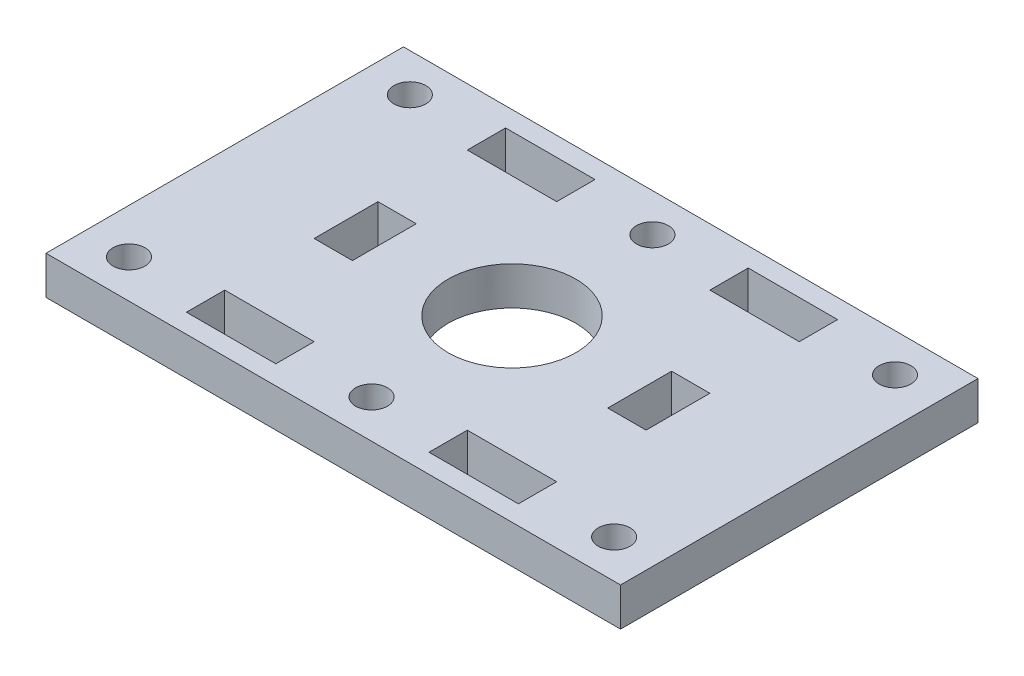
ISO-10303-21;
HEADER;
FILE_DESCRIPTION(('STEP AP214'),'2;1');
FILE_NAME('part.step','',(''),(''),'','','');
FILE_SCHEMA(('AUTOMOTIVE_DESIGN { 1 0 10303 214 1 1 1 1 }'));
ENDSEC;
DATA;
#1=APPLICATION_CONTEXT('core data for automotive mechanical design processes');
#2=APPLICATION_PROTOCOL_DEFINITION('international standard','automotive_design',2000,#1);
#3=PRODUCT_CONTEXT('',#1,'mechanical');
#4=PRODUCT('Part','Part','',(#3));
#5=PRODUCT_RELATED_PRODUCT_CATEGORY('part','',(#4));
#6=PRODUCT_DEFINITION_FORMATION('','',#4);
#7=PRODUCT_DEFINITION_CONTEXT('part definition',#1,'design');
#8=PRODUCT_DEFINITION('design','',#6,#7);
#9=PRODUCT_DEFINITION_SHAPE('','',#8);
#10=(LENGTH_UNIT() NAMED_UNIT(*) SI_UNIT(.MILLI.,.METRE.));
#11=(NAMED_UNIT(*) PLANE_ANGLE_UNIT() SI_UNIT($,.RADIAN.));
#12=(NAMED_UNIT(*) SI_UNIT($,.STERADIAN.) SOLID_ANGLE_UNIT());
#13=UNCERTAINTY_MEASURE_WITH_UNIT(LENGTH_MEASURE(1.E-05),#10,'distance_accuracy_value','');
#14=(GEOMETRIC_REPRESENTATION_CONTEXT(3) GLOBAL_UNCERTAINTY_ASSIGNED_CONTEXT((#13)) GLOBAL_UNIT_ASSIGNED_CONTEXT((#10,
#11,#12)) REPRESENTATION_CONTEXT('',''));
#15=CARTESIAN_POINT('',(0.,0.,0.));
#16=DIRECTION('',(0.,0.,1.));
#17=DIRECTION('',(1.,0.,0.));
#18=AXIS2_PLACEMENT_3D('',#15,#16,#17);
#19=CARTESIAN_POINT('',(0.,3.,0.));
#20=DIRECTION('',(1.,0.,0.));
#21=DIRECTION('',(0.,0.,-1.));
#22=AXIS2_PLACEMENT_3D('',#19,#20,#21);
#23=PLANE('',#22);
#24=DIRECTION('',(0.,0.,1.));
#25=VECTOR('',#24,1.);
#26=CARTESIAN_POINT('',(0.,0.,0.));
#27=LINE('',#26,#25);
#28=CARTESIAN_POINT('',(0.,0.,-28.));
#29=VERTEX_POINT('',#28);
#30=CARTESIAN_POINT('',(0.,0.,0.));
#31=VERTEX_POINT('',#30);
#32=EDGE_CURVE('E452',#29,#31,#27,.T.);
#33=ORIENTED_EDGE('',*,*,#32,.T.);
#34=DIRECTION('',(0.,-1.,0.));
#35=VECTOR('',#34,1.);
#36=CARTESIAN_POINT('',(0.,3.,0.));
#37=LINE('',#36,#35);
#38=CARTESIAN_POINT('',(0.,3.,0.));
#39=VERTEX_POINT('',#38);
#40=EDGE_CURVE('E11',#39,#31,#37,.T.);
#41=ORIENTED_EDGE('',*,*,#40,.F.);
#42=DIRECTION('',(0.,0.,1.));
#43=VECTOR('',#42,1.);
#44=CARTESIAN_POINT('',(0.,3.,0.));
#45=LINE('',#44,#43);
#46=CARTESIAN_POINT('',(0.,3.,-28.));
#47=VERTEX_POINT('',#46);
#48=EDGE_CURVE('E455',#47,#39,#45,.T.);
#49=ORIENTED_EDGE('',*,*,#48,.F.);
#50=DIRECTION('',(0.,-1.,0.));
#51=VECTOR('',#50,1.);
#52=CARTESIAN_POINT('',(0.,3.,-28.));
#53=LINE('',#52,#51);
#54=EDGE_CURVE('E465',#47,#29,#53,.T.);
#55=ORIENTED_EDGE('',*,*,#54,.T.);
#56=EDGE_LOOP('',(#33,#41,#49,#55));
#57=FACE_BOUND('',#56,.T.);
#58=ADVANCED_FACE('F34',(#57),#23,.F.);
#59=CARTESIAN_POINT('',(0.,3.,0.));
#60=DIRECTION('',(0.,0.,-1.));
#61=DIRECTION('',(-1.,0.,0.));
#62=AXIS2_PLACEMENT_3D('',#59,#60,#61);
#63=PLANE('',#62);
#64=DIRECTION('',(1.,0.,0.));
#65=VECTOR('',#64,1.);
#66=CARTESIAN_POINT('',(0.,0.,0.));
#67=LINE('',#66,#65);
#68=CARTESIAN_POINT('',(45.,0.,0.));
#69=VERTEX_POINT('',#68);
#70=EDGE_CURVE('E468',#31,#69,#67,.T.);
#71=ORIENTED_EDGE('',*,*,#70,.T.);
#72=DIRECTION('',(0.,-1.,0.));
#73=VECTOR('',#72,1.);
#74=CARTESIAN_POINT('',(45.,3.,0.));
#75=LINE('',#74,#73);
#76=CARTESIAN_POINT('',(45.,3.,0.));
#77=VERTEX_POINT('',#76);
#78=EDGE_CURVE('E42',#77,#69,#75,.T.);
#79=ORIENTED_EDGE('',*,*,#78,.F.);
#80=DIRECTION('',(1.,0.,0.));
#81=VECTOR('',#80,1.);
#82=CARTESIAN_POINT('',(0.,3.,0.));
#83=LINE('',#82,#81);
#84=EDGE_CURVE('E458',#39,#77,#83,.T.);
#85=ORIENTED_EDGE('',*,*,#84,.F.);
#86=ORIENTED_EDGE('',*,*,#40,.T.);
#87=EDGE_LOOP('',(#71,#79,#85,#86));
#88=FACE_BOUND('',#87,.T.);
#89=ADVANCED_FACE('F498',(#88),#63,.F.);
#90=CARTESIAN_POINT('',(45.,3.,0.));
#91=DIRECTION('',(-1.,0.,0.));
#92=DIRECTION('',(0.,0.,1.));
#93=AXIS2_PLACEMENT_3D('',#90,#91,#92);
#94=PLANE('',#93);
#95=DIRECTION('',(0.,0.,-1.));
#96=VECTOR('',#95,1.);
#97=CARTESIAN_POINT('',(45.,0.,0.));
#98=LINE('',#97,#96);
#99=CARTESIAN_POINT('',(45.,0.,-28.));
#100=VERTEX_POINT('',#99);
#101=EDGE_CURVE('E470',#69,#100,#98,.T.);
#102=ORIENTED_EDGE('',*,*,#101,.T.);
#103=DIRECTION('',(0.,-1.,0.));
#104=VECTOR('',#103,1.);
#105=CARTESIAN_POINT('',(45.,3.,-28.));
#106=LINE('',#105,#104);
#107=CARTESIAN_POINT('',(45.,3.,-28.));
#108=VERTEX_POINT('',#107);
#109=EDGE_CURVE('E475',#108,#100,#106,.T.);
#110=ORIENTED_EDGE('',*,*,#109,.F.);
#111=DIRECTION('',(0.,0.,-1.));
#112=VECTOR('',#111,1.);
#113=CARTESIAN_POINT('',(45.,3.,0.));
#114=LINE('',#113,#112);
#115=EDGE_CURVE('E461',#77,#108,#114,.T.);
#116=ORIENTED_EDGE('',*,*,#115,.F.);
#117=ORIENTED_EDGE('',*,*,#78,.T.);
#118=EDGE_LOOP('',(#102,#110,#116,#117));
#119=FACE_BOUND('',#118,.T.);
#120=ADVANCED_FACE('F483',(#119),#94,.F.);
#121=CARTESIAN_POINT('',(0.,3.,-28.));
#122=DIRECTION('',(0.,0.,1.));
#123=DIRECTION('',(1.,0.,0.));
#124=AXIS2_PLACEMENT_3D('',#121,#122,#123);
#125=PLANE('',#124);
#126=DIRECTION('',(-1.,0.,0.));
#127=VECTOR('',#126,1.);
#128=CARTESIAN_POINT('',(0.,0.,-28.));
#129=LINE('',#128,#127);
#130=EDGE_CURVE('E459',#100,#29,#129,.T.);
#131=ORIENTED_EDGE('',*,*,#130,.T.);
#132=ORIENTED_EDGE('',*,*,#54,.F.);
#133=DIRECTION('',(-1.,0.,0.));
#134=VECTOR('',#133,1.);
#135=CARTESIAN_POINT('',(0.,3.,-28.));
#136=LINE('',#135,#134);
#137=EDGE_CURVE('E463',#108,#47,#136,.T.);
#138=ORIENTED_EDGE('',*,*,#137,.F.);
#139=ORIENTED_EDGE('',*,*,#109,.T.);
#140=EDGE_LOOP('',(#131,#132,#138,#139));
#141=FACE_BOUND('',#140,.T.);
#142=ADVANCED_FACE('F491',(#141),#125,.F.);
#143=CARTESIAN_POINT('',(0.,3.,0.));
#144=DIRECTION('',(0.,-1.,0.));
#145=DIRECTION('',(0.,0.,-1.));
#146=AXIS2_PLACEMENT_3D('',#143,#144,#145);
#147=PLANE('',#146);
#148=CARTESIAN_POINT('',(22.5,3.,-14.));
#149=DIRECTION('',(0.,1.,0.));
#150=DIRECTION('',(0.,0.,1.));
#151=AXIS2_PLACEMENT_3D('',#148,#149,#150);
#152=CIRCLE('',#151,5.);
#153=CARTESIAN_POINT('',(22.5,3.,-9.));
#154=VERTEX_POINT('',#153);
#155=EDGE_CURVE('E246',#154,#154,#152,.T.);
#156=ORIENTED_EDGE('',*,*,#155,.F.);
#157=EDGE_LOOP('',(#156));
#158=FACE_BOUND('',#157,.T.);
#159=DIRECTION('',(1.,0.,0.));
#160=VECTOR('',#159,1.);
#161=CARTESIAN_POINT('',(9.49999999999999,3.,-11.5));
#162=LINE('',#161,#160);
#163=CARTESIAN_POINT('',(9.49999999999999,3.,-11.5));
#164=VERTEX_POINT('',#163);
#165=CARTESIAN_POINT('',(12.5,3.,-11.5));
#166=VERTEX_POINT('',#165);
#167=EDGE_CURVE('E251',#164,#166,#162,.T.);
#168=ORIENTED_EDGE('',*,*,#167,.F.);
#169=DIRECTION('',(0.,0.,1.));
#170=VECTOR('',#169,1.);
#171=CARTESIAN_POINT('',(9.49999999999999,3.,-11.5));
#172=LINE('',#171,#170);
#173=CARTESIAN_POINT('',(9.49999999999999,3.,-16.5));
#174=VERTEX_POINT('',#173);
#175=EDGE_CURVE('E49',#174,#164,#172,.T.);
#176=ORIENTED_EDGE('',*,*,#175,.F.);
#177=DIRECTION('',(-1.,0.,0.));
#178=VECTOR('',#177,1.);
#179=CARTESIAN_POINT('',(9.49999999999999,3.,-16.5));
#180=LINE('',#179,#178);
#181=CARTESIAN_POINT('',(12.5,3.,-16.5));
#182=VERTEX_POINT('',#181);
#183=EDGE_CURVE('E240',#182,#174,#180,.T.);
#184=ORIENTED_EDGE('',*,*,#183,.F.);
#185=DIRECTION('',(0.,0.,-1.));
#186=VECTOR('',#185,1.);
#187=CARTESIAN_POINT('',(12.5,3.,-11.5));
#188=LINE('',#187,#186);
#189=EDGE_CURVE('E243',#166,#182,#188,.T.);
#190=ORIENTED_EDGE('',*,*,#189,.F.);
#191=EDGE_LOOP('',(#168,#176,#184,#190));
#192=FACE_BOUND('',#191,.T.);
#193=DIRECTION('',(-1.,0.,0.));
#194=VECTOR('',#193,1.);
#195=CARTESIAN_POINT('',(35.5,3.,-16.5));
#196=LINE('',#195,#194);
#197=CARTESIAN_POINT('',(35.5,3.,-16.5));
#198=VERTEX_POINT('',#197);
#199=CARTESIAN_POINT('',(32.5,3.,-16.5));
#200=VERTEX_POINT('',#199);
#201=EDGE_CURVE('E277',#198,#200,#196,.T.);
#202=ORIENTED_EDGE('',*,*,#201,.F.);
#203=DIRECTION('',(0.,0.,-1.));
#204=VECTOR('',#203,1.);
#205=CARTESIAN_POINT('',(35.5,3.,-11.5));
#206=LINE('',#205,#204);
#207=CARTESIAN_POINT('',(35.5,3.,-11.5));
#208=VERTEX_POINT('',#207);
#209=EDGE_CURVE('E57',#208,#198,#206,.T.);
#210=ORIENTED_EDGE('',*,*,#209,.F.);
#211=DIRECTION('',(1.,0.,0.));
#212=VECTOR('',#211,1.);
#213=CARTESIAN_POINT('',(35.5,3.,-11.5));
#214=LINE('',#213,#212);
#215=CARTESIAN_POINT('',(32.5,3.,-11.5));
#216=VERTEX_POINT('',#215);
#217=EDGE_CURVE('E266',#216,#208,#214,.T.);
#218=ORIENTED_EDGE('',*,*,#217,.F.);
#219=DIRECTION('',(0.,0.,1.));
#220=VECTOR('',#219,1.);
#221=CARTESIAN_POINT('',(32.5,3.,-11.5));
#222=LINE('',#221,#220);
#223=EDGE_CURVE('E280',#200,#216,#222,.T.);
#224=ORIENTED_EDGE('',*,*,#223,.F.);
#225=EDGE_LOOP('',(#202,#210,#218,#224));
#226=FACE_BOUND('',#225,.T.);
#227=CARTESIAN_POINT('',(41.5,3.,-25.));
#228=DIRECTION('',(0.,1.,0.));
#229=DIRECTION('',(0.,0.,1.));
#230=AXIS2_PLACEMENT_3D('',#227,#228,#229);
#231=CIRCLE('',#230,1.25);
#232=CARTESIAN_POINT('',(41.5,3.,-23.75));
#233=VERTEX_POINT('',#232);
#234=EDGE_CURVE('E391',#233,#233,#231,.T.);
#235=ORIENTED_EDGE('',*,*,#234,.F.);
#236=EDGE_LOOP('',(#235));
#237=FACE_BOUND('',#236,.T.);
#238=CARTESIAN_POINT('',(3.49999999999999,3.,-25.));
#239=DIRECTION('',(0.,1.,0.));
#240=DIRECTION('',(0.,0.,-1.));
#241=AXIS2_PLACEMENT_3D('',#238,#239,#240);
#242=CIRCLE('',#241,1.25);
#243=CARTESIAN_POINT('',(3.49999999999999,3.,-26.25));
#244=VERTEX_POINT('',#243);
#245=EDGE_CURVE('E350',#244,#244,#242,.T.);
#246=ORIENTED_EDGE('',*,*,#245,.F.);
#247=EDGE_LOOP('',(#246));
#248=FACE_BOUND('',#247,.T.);
#249=DIRECTION('',(-1.,0.,0.));
#250=VECTOR('',#249,1.);
#251=CARTESIAN_POINT('',(35.5,3.,-4.5));
#252=LINE('',#251,#250);
#253=CARTESIAN_POINT('',(35.5,3.,-4.5));
#254=VERTEX_POINT('',#253);
#255=CARTESIAN_POINT('',(28.5,3.,-4.5));
#256=VERTEX_POINT('',#255);
#257=EDGE_CURVE('E339',#254,#256,#252,.T.);
#258=ORIENTED_EDGE('',*,*,#257,.F.);
#259=DIRECTION('',(0.,0.,-1.));
#260=VECTOR('',#259,1.);
#261=CARTESIAN_POINT('',(35.5,3.,-4.5));
#262=LINE('',#261,#260);
#263=CARTESIAN_POINT('',(35.5,3.,-1.5));
#264=VERTEX_POINT('',#263);
#265=EDGE_CURVE('E337',#264,#254,#262,.T.);
#266=ORIENTED_EDGE('',*,*,#265,.F.);
#267=DIRECTION('',(1.,0.,0.));
#268=VECTOR('',#267,1.);
#269=CARTESIAN_POINT('',(35.5,3.,-1.5));
#270=LINE('',#269,#268);
#271=CARTESIAN_POINT('',(28.5,3.,-1.5));
#272=VERTEX_POINT('',#271);
#273=EDGE_CURVE('E327',#272,#264,#270,.T.);
#274=ORIENTED_EDGE('',*,*,#273,.F.);
#275=DIRECTION('',(0.,0.,1.));
#276=VECTOR('',#275,1.);
#277=CARTESIAN_POINT('',(28.5,3.,-4.5));
#278=LINE('',#277,#276);
#279=EDGE_CURVE('E343',#256,#272,#278,.T.);
#280=ORIENTED_EDGE('',*,*,#279,.F.);
#281=EDGE_LOOP('',(#258,#266,#274,#280));
#282=FACE_BOUND('',#281,.T.);
#283=DIRECTION('',(0.,0.,-1.));
#284=VECTOR('',#283,1.);
#285=CARTESIAN_POINT('',(35.5,3.,-23.5));
#286=LINE('',#285,#284);
#287=CARTESIAN_POINT('',(35.5,3.,-23.5));
#288=VERTEX_POINT('',#287);
#289=CARTESIAN_POINT('',(35.5,3.,-26.5));
#290=VERTEX_POINT('',#289);
#291=EDGE_CURVE('E372',#288,#290,#286,.T.);
#292=ORIENTED_EDGE('',*,*,#291,.F.);
#293=DIRECTION('',(1.,0.,0.));
#294=VECTOR('',#293,1.);
#295=CARTESIAN_POINT('',(35.5,3.,-23.5));
#296=LINE('',#295,#294);
#297=CARTESIAN_POINT('',(28.5,3.,-23.5));
#298=VERTEX_POINT('',#297);
#299=EDGE_CURVE('E316',#298,#288,#296,.T.);
#300=ORIENTED_EDGE('',*,*,#299,.F.);
#301=DIRECTION('',(0.,0.,1.));
#302=VECTOR('',#301,1.);
#303=CARTESIAN_POINT('',(28.5,3.,-23.5));
#304=LINE('',#303,#302);
#305=CARTESIAN_POINT('',(28.5,3.,-26.5));
#306=VERTEX_POINT('',#305);
#307=EDGE_CURVE('E361',#306,#298,#304,.T.);
#308=ORIENTED_EDGE('',*,*,#307,.F.);
#309=DIRECTION('',(-1.,0.,0.));
#310=VECTOR('',#309,1.);
#311=CARTESIAN_POINT('',(35.5,3.,-26.5));
#312=LINE('',#311,#310);
#313=EDGE_CURVE('E375',#290,#306,#312,.T.);
#314=ORIENTED_EDGE('',*,*,#313,.F.);
#315=EDGE_LOOP('',(#292,#300,#308,#314));
#316=FACE_BOUND('',#315,.T.);
#317=CARTESIAN_POINT('',(22.5,3.,-25.));
#318=DIRECTION('',(0.,1.,0.));
#319=DIRECTION('',(0.,0.,-1.));
#320=AXIS2_PLACEMENT_3D('',#317,#318,#319);
#321=CIRCLE('',#320,1.25);
#322=CARTESIAN_POINT('',(22.5,3.,-26.25));
#323=VERTEX_POINT('',#322);
#324=EDGE_CURVE('E441',#323,#323,#321,.T.);
#325=ORIENTED_EDGE('',*,*,#324,.F.);
#326=EDGE_LOOP('',(#325));
#327=FACE_BOUND('',#326,.T.);
#328=CARTESIAN_POINT('',(3.5,3.,-3.));
#329=DIRECTION('',(0.,1.,0.));
#330=DIRECTION('',(0.,0.,1.));
#331=AXIS2_PLACEMENT_3D('',#328,#329,#330);
#332=CIRCLE('',#331,1.25);
#333=CARTESIAN_POINT('',(3.5,3.,-1.75));
#334=VERTEX_POINT('',#333);
#335=EDGE_CURVE('E402',#334,#334,#332,.T.);
#336=ORIENTED_EDGE('',*,*,#335,.F.);
#337=EDGE_LOOP('',(#336));
#338=FACE_BOUND('',#337,.T.);
#339=CARTESIAN_POINT('',(41.5,3.,-3.00000000000001));
#340=DIRECTION('',(0.,1.,0.));
#341=DIRECTION('',(0.,0.,-1.));
#342=AXIS2_PLACEMENT_3D('',#339,#340,#341);
#343=CIRCLE('',#342,1.25);
#344=CARTESIAN_POINT('',(41.5,3.,-4.25));
#345=VERTEX_POINT('',#344);
#346=EDGE_CURVE('E403',#345,#345,#343,.T.);
#347=ORIENTED_EDGE('',*,*,#346,.F.);
#348=EDGE_LOOP('',(#347));
#349=FACE_BOUND('',#348,.T.);
#350=DIRECTION('',(1.,0.,0.));
#351=VECTOR('',#350,1.);
#352=CARTESIAN_POINT('',(9.5,3.,-1.5));
#353=LINE('',#352,#351);
#354=CARTESIAN_POINT('',(9.5,3.,-1.5));
#355=VERTEX_POINT('',#354);
#356=CARTESIAN_POINT('',(16.5,3.,-1.5));
#357=VERTEX_POINT('',#356);
#358=EDGE_CURVE('E422',#355,#357,#353,.T.);
#359=ORIENTED_EDGE('',*,*,#358,.F.);
#360=DIRECTION('',(0.,0.,1.));
#361=VECTOR('',#360,1.);
#362=CARTESIAN_POINT('',(9.5,3.,-4.5));
#363=LINE('',#362,#361);
#364=CARTESIAN_POINT('',(9.5,3.,-4.5));
#365=VERTEX_POINT('',#364);
#366=EDGE_CURVE('E390',#365,#355,#363,.T.);
#367=ORIENTED_EDGE('',*,*,#366,.F.);
#368=DIRECTION('',(-1.,0.,0.));
#369=VECTOR('',#368,1.);
#370=CARTESIAN_POINT('',(9.5,3.,-4.5));
#371=LINE('',#370,#369);
#372=CARTESIAN_POINT('',(16.5,3.,-4.5));
#373=VERTEX_POINT('',#372);
#374=EDGE_CURVE('E411',#373,#365,#371,.T.);
#375=ORIENTED_EDGE('',*,*,#374,.F.);
#376=DIRECTION('',(0.,0.,-1.));
#377=VECTOR('',#376,1.);
#378=CARTESIAN_POINT('',(16.5,3.,-4.5));
#379=LINE('',#378,#377);
#380=EDGE_CURVE('E425',#357,#373,#379,.T.);
#381=ORIENTED_EDGE('',*,*,#380,.F.);
#382=EDGE_LOOP('',(#359,#367,#375,#381));
#383=FACE_BOUND('',#382,.T.);
#384=DIRECTION('',(1.,0.,0.));
#385=VECTOR('',#384,1.);
#386=CARTESIAN_POINT('',(9.49999999999999,3.,-23.5));
#387=LINE('',#386,#385);
#388=CARTESIAN_POINT('',(9.49999999999999,3.,-23.5));
#389=VERTEX_POINT('',#388);
#390=CARTESIAN_POINT('',(16.5,3.,-23.5));
#391=VERTEX_POINT('',#390);
#392=EDGE_CURVE('E306',#389,#391,#387,.T.);
#393=ORIENTED_EDGE('',*,*,#392,.F.);
#394=DIRECTION('',(0.,0.,1.));
#395=VECTOR('',#394,1.);
#396=CARTESIAN_POINT('',(9.49999999999999,3.,-23.5));
#397=LINE('',#396,#395);
#398=CARTESIAN_POINT('',(9.49999999999999,3.,-26.5));
#399=VERTEX_POINT('',#398);
#400=EDGE_CURVE('E258',#399,#389,#397,.T.);
#401=ORIENTED_EDGE('',*,*,#400,.F.);
#402=DIRECTION('',(-1.,0.,0.));
#403=VECTOR('',#402,1.);
#404=CARTESIAN_POINT('',(9.49999999999999,3.,-26.5));
#405=LINE('',#404,#403);
#406=CARTESIAN_POINT('',(16.5,3.,-26.5));
#407=VERTEX_POINT('',#406);
#408=EDGE_CURVE('E295',#407,#399,#405,.T.);
#409=ORIENTED_EDGE('',*,*,#408,.F.);
#410=DIRECTION('',(0.,0.,-1.));
#411=VECTOR('',#410,1.);
#412=CARTESIAN_POINT('',(16.5,3.,-23.5));
#413=LINE('',#412,#411);
#414=EDGE_CURVE('E309',#391,#407,#413,.T.);
#415=ORIENTED_EDGE('',*,*,#414,.F.);
#416=EDGE_LOOP('',(#393,#401,#409,#415));
#417=FACE_BOUND('',#416,.T.);
#418=CARTESIAN_POINT('',(22.5,3.,-3.00000000000001));
#419=DIRECTION('',(0.,1.,0.));
#420=DIRECTION('',(0.,0.,1.));
#421=AXIS2_PLACEMENT_3D('',#418,#419,#420);
#422=CIRCLE('',#421,1.25);
#423=CARTESIAN_POINT('',(22.5,3.,-1.75000000000001));
#424=VERTEX_POINT('',#423);
#425=EDGE_CURVE('E440',#424,#424,#422,.T.);
#426=ORIENTED_EDGE('',*,*,#425,.F.);
#427=EDGE_LOOP('',(#426));
#428=FACE_BOUND('',#427,.T.);
#429=ORIENTED_EDGE('',*,*,#48,.T.);
#430=ORIENTED_EDGE('',*,*,#84,.T.);
#431=ORIENTED_EDGE('',*,*,#115,.T.);
#432=ORIENTED_EDGE('',*,*,#137,.T.);
#433=EDGE_LOOP('',(#429,#430,#431,#432));
#434=FACE_BOUND('',#433,.T.);
#435=ADVANCED_FACE('F497',(#158,#192,#226,#237,#248,#282,#316,#327,#338,#349,#383,#417,#428,
#434),#147,.F.);
#436=CARTESIAN_POINT('',(0.,0.,0.));
#437=DIRECTION('',(0.,-1.,0.));
#438=DIRECTION('',(0.,0.,-1.));
#439=AXIS2_PLACEMENT_3D('',#436,#437,#438);
#440=PLANE('',#439);
#441=CARTESIAN_POINT('',(22.5,0.,-14.));
#442=DIRECTION('',(0.,-1.,0.));
#443=DIRECTION('',(0.,0.,-1.));
#444=AXIS2_PLACEMENT_3D('',#441,#442,#443);
#445=CIRCLE('',#444,5.);
#446=CARTESIAN_POINT('',(22.5,0.,-19.));
#447=VERTEX_POINT('',#446);
#448=EDGE_CURVE('E37',#447,#447,#445,.T.);
#449=ORIENTED_EDGE('',*,*,#448,.F.);
#450=EDGE_LOOP('',(#449));
#451=FACE_BOUND('',#450,.T.);
#452=DIRECTION('',(0.,0.,1.));
#453=VECTOR('',#452,1.);
#454=CARTESIAN_POINT('',(9.49999999999999,0.,-11.5));
#455=LINE('',#454,#453);
#456=CARTESIAN_POINT('',(9.49999999999999,0.,-16.5));
#457=VERTEX_POINT('',#456);
#458=CARTESIAN_POINT('',(9.49999999999999,0.,-11.5));
#459=VERTEX_POINT('',#458);
#460=EDGE_CURVE('E221',#457,#459,#455,.T.);
#461=ORIENTED_EDGE('',*,*,#460,.T.);
#462=DIRECTION('',(1.,0.,0.));
#463=VECTOR('',#462,1.);
#464=CARTESIAN_POINT('',(9.49999999999999,0.,-11.5));
#465=LINE('',#464,#463);
#466=CARTESIAN_POINT('',(12.5,0.,-11.5));
#467=VERTEX_POINT('',#466);
#468=EDGE_CURVE('E231',#459,#467,#465,.T.);
#469=ORIENTED_EDGE('',*,*,#468,.T.);
#470=DIRECTION('',(0.,0.,-1.));
#471=VECTOR('',#470,1.);
#472=CARTESIAN_POINT('',(12.5,0.,-11.5));
#473=LINE('',#472,#471);
#474=CARTESIAN_POINT('',(12.5,0.,-16.5));
#475=VERTEX_POINT('',#474);
#476=EDGE_CURVE('E235',#467,#475,#473,.T.);
#477=ORIENTED_EDGE('',*,*,#476,.T.);
#478=DIRECTION('',(-1.,0.,0.));
#479=VECTOR('',#478,1.);
#480=CARTESIAN_POINT('',(9.49999999999999,0.,-16.5));
#481=LINE('',#480,#479);
#482=EDGE_CURVE('E227',#475,#457,#481,.T.);
#483=ORIENTED_EDGE('',*,*,#482,.T.);
#484=EDGE_LOOP('',(#461,#469,#477,#483));
#485=FACE_BOUND('',#484,.T.);
#486=DIRECTION('',(0.,0.,-1.));
#487=VECTOR('',#486,1.);
#488=CARTESIAN_POINT('',(35.5,0.,-11.5));
#489=LINE('',#488,#487);
#490=CARTESIAN_POINT('',(35.5,0.,-11.5));
#491=VERTEX_POINT('',#490);
#492=CARTESIAN_POINT('',(35.5,0.,-16.5));
#493=VERTEX_POINT('',#492);
#494=EDGE_CURVE('E262',#491,#493,#489,.T.);
#495=ORIENTED_EDGE('',*,*,#494,.T.);
#496=DIRECTION('',(-1.,0.,0.));
#497=VECTOR('',#496,1.);
#498=CARTESIAN_POINT('',(35.5,0.,-16.5));
#499=LINE('',#498,#497);
#500=CARTESIAN_POINT('',(32.5,0.,-16.5));
#501=VERTEX_POINT('',#500);
#502=EDGE_CURVE('E265',#493,#501,#499,.T.);
#503=ORIENTED_EDGE('',*,*,#502,.T.);
#504=DIRECTION('',(0.,0.,1.));
#505=VECTOR('',#504,1.);
#506=CARTESIAN_POINT('',(32.5,0.,-11.5));
#507=LINE('',#506,#505);
#508=CARTESIAN_POINT('',(32.5,0.,-11.5));
#509=VERTEX_POINT('',#508);
#510=EDGE_CURVE('E269',#501,#509,#507,.T.);
#511=ORIENTED_EDGE('',*,*,#510,.T.);
#512=DIRECTION('',(1.,0.,0.));
#513=VECTOR('',#512,1.);
#514=CARTESIAN_POINT('',(35.5,0.,-11.5));
#515=LINE('',#514,#513);
#516=EDGE_CURVE('E272',#509,#491,#515,.T.);
#517=ORIENTED_EDGE('',*,*,#516,.T.);
#518=EDGE_LOOP('',(#495,#503,#511,#517));
#519=FACE_BOUND('',#518,.T.);
#520=CARTESIAN_POINT('',(41.5,0.,-25.));
#521=DIRECTION('',(0.,1.,0.));
#522=DIRECTION('',(0.,0.,1.));
#523=AXIS2_PLACEMENT_3D('',#520,#521,#522);
#524=CIRCLE('',#523,1.25);
#525=CARTESIAN_POINT('',(41.5,0.,-23.75));
#526=VERTEX_POINT('',#525);
#527=EDGE_CURVE('E387',#526,#526,#524,.T.);
#528=ORIENTED_EDGE('',*,*,#527,.T.);
#529=EDGE_LOOP('',(#528));
#530=FACE_BOUND('',#529,.T.);
#531=CARTESIAN_POINT('',(3.49999999999999,0.,-25.));
#532=DIRECTION('',(0.,1.,0.));
#533=DIRECTION('',(0.,0.,-1.));
#534=AXIS2_PLACEMENT_3D('',#531,#532,#533);
#535=CIRCLE('',#534,1.25);
#536=CARTESIAN_POINT('',(3.49999999999999,0.,-26.25));
#537=VERTEX_POINT('',#536);
#538=EDGE_CURVE('E394',#537,#537,#535,.T.);
#539=ORIENTED_EDGE('',*,*,#538,.T.);
#540=EDGE_LOOP('',(#539));
#541=FACE_BOUND('',#540,.T.);
#542=DIRECTION('',(0.,0.,-1.));
#543=VECTOR('',#542,1.);
#544=CARTESIAN_POINT('',(35.5,0.,-4.5));
#545=LINE('',#544,#543);
#546=CARTESIAN_POINT('',(35.5,0.,-1.5));
#547=VERTEX_POINT('',#546);
#548=CARTESIAN_POINT('',(35.5,0.,-4.5));
#549=VERTEX_POINT('',#548);
#550=EDGE_CURVE('E323',#547,#549,#545,.T.);
#551=ORIENTED_EDGE('',*,*,#550,.T.);
#552=DIRECTION('',(-1.,0.,0.));
#553=VECTOR('',#552,1.);
#554=CARTESIAN_POINT('',(35.5,0.,-4.5));
#555=LINE('',#554,#553);
#556=CARTESIAN_POINT('',(28.5,0.,-4.5));
#557=VERTEX_POINT('',#556);
#558=EDGE_CURVE('E326',#549,#557,#555,.T.);
#559=ORIENTED_EDGE('',*,*,#558,.T.);
#560=DIRECTION('',(0.,0.,1.));
#561=VECTOR('',#560,1.);
#562=CARTESIAN_POINT('',(28.5,0.,-4.5));
#563=LINE('',#562,#561);
#564=CARTESIAN_POINT('',(28.5,0.,-1.5));
#565=VERTEX_POINT('',#564);
#566=EDGE_CURVE('E330',#557,#565,#563,.T.);
#567=ORIENTED_EDGE('',*,*,#566,.T.);
#568=DIRECTION('',(1.,0.,0.));
#569=VECTOR('',#568,1.);
#570=CARTESIAN_POINT('',(35.5,0.,-1.5));
#571=LINE('',#570,#569);
#572=EDGE_CURVE('E333',#565,#547,#571,.T.);
#573=ORIENTED_EDGE('',*,*,#572,.T.);
#574=EDGE_LOOP('',(#551,#559,#567,#573));
#575=FACE_BOUND('',#574,.T.);
#576=DIRECTION('',(1.,0.,0.));
#577=VECTOR('',#576,1.);
#578=CARTESIAN_POINT('',(35.5,0.,-23.5));
#579=LINE('',#578,#577);
#580=CARTESIAN_POINT('',(28.5,0.,-23.5));
#581=VERTEX_POINT('',#580);
#582=CARTESIAN_POINT('',(35.5,0.,-23.5));
#583=VERTEX_POINT('',#582);
#584=EDGE_CURVE('E357',#581,#583,#579,.T.);
#585=ORIENTED_EDGE('',*,*,#584,.T.);
#586=DIRECTION('',(0.,0.,-1.));
#587=VECTOR('',#586,1.);
#588=CARTESIAN_POINT('',(35.5,0.,-23.5));
#589=LINE('',#588,#587);
#590=CARTESIAN_POINT('',(35.5,0.,-26.5));
#591=VERTEX_POINT('',#590);
#592=EDGE_CURVE('E360',#583,#591,#589,.T.);
#593=ORIENTED_EDGE('',*,*,#592,.T.);
#594=DIRECTION('',(-1.,0.,0.));
#595=VECTOR('',#594,1.);
#596=CARTESIAN_POINT('',(35.5,0.,-26.5));
#597=LINE('',#596,#595);
#598=CARTESIAN_POINT('',(28.5,0.,-26.5));
#599=VERTEX_POINT('',#598);
#600=EDGE_CURVE('E364',#591,#599,#597,.T.);
#601=ORIENTED_EDGE('',*,*,#600,.T.);
#602=DIRECTION('',(0.,0.,1.));
#603=VECTOR('',#602,1.);
#604=CARTESIAN_POINT('',(28.5,0.,-23.5));
#605=LINE('',#604,#603);
#606=EDGE_CURVE('E367',#599,#581,#605,.T.);
#607=ORIENTED_EDGE('',*,*,#606,.T.);
#608=EDGE_LOOP('',(#585,#593,#601,#607));
#609=FACE_BOUND('',#608,.T.);
#610=CARTESIAN_POINT('',(22.5,0.,-25.));
#611=DIRECTION('',(0.,1.,0.));
#612=DIRECTION('',(0.,0.,-1.));
#613=AXIS2_PLACEMENT_3D('',#610,#611,#612);
#614=CIRCLE('',#613,1.25);
#615=CARTESIAN_POINT('',(22.5,0.,-26.25));
#616=VERTEX_POINT('',#615);
#617=EDGE_CURVE('E437',#616,#616,#614,.T.);
#618=ORIENTED_EDGE('',*,*,#617,.T.);
#619=EDGE_LOOP('',(#618));
#620=FACE_BOUND('',#619,.T.);
#621=CARTESIAN_POINT('',(3.5,0.,-3.));
#622=DIRECTION('',(0.,1.,0.));
#623=DIRECTION('',(0.,0.,1.));
#624=AXIS2_PLACEMENT_3D('',#621,#622,#623);
#625=CIRCLE('',#624,1.25);
#626=CARTESIAN_POINT('',(3.5,0.,-1.75));
#627=VERTEX_POINT('',#626);
#628=EDGE_CURVE('E444',#627,#627,#625,.T.);
#629=ORIENTED_EDGE('',*,*,#628,.T.);
#630=EDGE_LOOP('',(#629));
#631=FACE_BOUND('',#630,.T.);
#632=CARTESIAN_POINT('',(41.5,0.,-3.00000000000001));
#633=DIRECTION('',(0.,1.,0.));
#634=DIRECTION('',(0.,0.,-1.));
#635=AXIS2_PLACEMENT_3D('',#632,#633,#634);
#636=CIRCLE('',#635,1.25);
#637=CARTESIAN_POINT('',(41.5,0.,-4.25));
#638=VERTEX_POINT('',#637);
#639=EDGE_CURVE('E399',#638,#638,#636,.T.);
#640=ORIENTED_EDGE('',*,*,#639,.T.);
#641=EDGE_LOOP('',(#640));
#642=FACE_BOUND('',#641,.T.);
#643=DIRECTION('',(0.,0.,1.));
#644=VECTOR('',#643,1.);
#645=CARTESIAN_POINT('',(9.5,0.,-4.5));
#646=LINE('',#645,#644);
#647=CARTESIAN_POINT('',(9.5,0.,-4.5));
#648=VERTEX_POINT('',#647);
#649=CARTESIAN_POINT('',(9.5,0.,-1.5));
#650=VERTEX_POINT('',#649);
#651=EDGE_CURVE('E407',#648,#650,#646,.T.);
#652=ORIENTED_EDGE('',*,*,#651,.T.);
#653=DIRECTION('',(1.,0.,0.));
#654=VECTOR('',#653,1.);
#655=CARTESIAN_POINT('',(9.5,0.,-1.5));
#656=LINE('',#655,#654);
#657=CARTESIAN_POINT('',(16.5,0.,-1.5));
#658=VERTEX_POINT('',#657);
#659=EDGE_CURVE('E410',#650,#658,#656,.T.);
#660=ORIENTED_EDGE('',*,*,#659,.T.);
#661=DIRECTION('',(0.,0.,-1.));
#662=VECTOR('',#661,1.);
#663=CARTESIAN_POINT('',(16.5,0.,-4.5));
#664=LINE('',#663,#662);
#665=CARTESIAN_POINT('',(16.5,0.,-4.5));
#666=VERTEX_POINT('',#665);
#667=EDGE_CURVE('E414',#658,#666,#664,.T.);
#668=ORIENTED_EDGE('',*,*,#667,.T.);
#669=DIRECTION('',(-1.,0.,0.));
#670=VECTOR('',#669,1.);
#671=CARTESIAN_POINT('',(9.5,0.,-4.5));
#672=LINE('',#671,#670);
#673=EDGE_CURVE('E417',#666,#648,#672,.T.);
#674=ORIENTED_EDGE('',*,*,#673,.T.);
#675=EDGE_LOOP('',(#652,#660,#668,#674));
#676=FACE_BOUND('',#675,.T.);
#677=DIRECTION('',(0.,0.,1.));
#678=VECTOR('',#677,1.);
#679=CARTESIAN_POINT('',(9.49999999999999,0.,-23.5));
#680=LINE('',#679,#678);
#681=CARTESIAN_POINT('',(9.49999999999999,0.,-26.5));
#682=VERTEX_POINT('',#681);
#683=CARTESIAN_POINT('',(9.49999999999999,0.,-23.5));
#684=VERTEX_POINT('',#683);
#685=EDGE_CURVE('E291',#682,#684,#680,.T.);
#686=ORIENTED_EDGE('',*,*,#685,.T.);
#687=DIRECTION('',(1.,0.,0.));
#688=VECTOR('',#687,1.);
#689=CARTESIAN_POINT('',(9.49999999999999,0.,-23.5));
#690=LINE('',#689,#688);
#691=CARTESIAN_POINT('',(16.5,0.,-23.5));
#692=VERTEX_POINT('',#691);
#693=EDGE_CURVE('E294',#684,#692,#690,.T.);
#694=ORIENTED_EDGE('',*,*,#693,.T.);
#695=DIRECTION('',(0.,0.,-1.));
#696=VECTOR('',#695,1.);
#697=CARTESIAN_POINT('',(16.5,0.,-23.5));
#698=LINE('',#697,#696);
#699=CARTESIAN_POINT('',(16.5,0.,-26.5));
#700=VERTEX_POINT('',#699);
#701=EDGE_CURVE('E298',#692,#700,#698,.T.);
#702=ORIENTED_EDGE('',*,*,#701,.T.);
#703=DIRECTION('',(-1.,0.,0.));
#704=VECTOR('',#703,1.);
#705=CARTESIAN_POINT('',(9.49999999999999,0.,-26.5));
#706=LINE('',#705,#704);
#707=EDGE_CURVE('E301',#700,#682,#706,.T.);
#708=ORIENTED_EDGE('',*,*,#707,.T.);
#709=EDGE_LOOP('',(#686,#694,#702,#708));
#710=FACE_BOUND('',#709,.T.);
#711=CARTESIAN_POINT('',(22.5,0.,-3.00000000000001));
#712=DIRECTION('',(0.,1.,0.));
#713=DIRECTION('',(0.,0.,1.));
#714=AXIS2_PLACEMENT_3D('',#711,#712,#713);
#715=CIRCLE('',#714,1.25);
#716=CARTESIAN_POINT('',(22.5,0.,-1.75000000000001));
#717=VERTEX_POINT('',#716);
#718=EDGE_CURVE('E449',#717,#717,#715,.T.);
#719=ORIENTED_EDGE('',*,*,#718,.T.);
#720=EDGE_LOOP('',(#719));
#721=FACE_BOUND('',#720,.T.);
#722=ORIENTED_EDGE('',*,*,#32,.F.);
#723=ORIENTED_EDGE('',*,*,#130,.F.);
#724=ORIENTED_EDGE('',*,*,#101,.F.);
#725=ORIENTED_EDGE('',*,*,#70,.F.);
#726=EDGE_LOOP('',(#722,#723,#724,#725));
#727=FACE_BOUND('',#726,.T.);
#728=ADVANCED_FACE('F237',(#451,#485,#519,#530,#541,#575,#609,#620,#631,#642,#676,#710,#721,
#727),#440,.T.);
#729=CARTESIAN_POINT('',(22.5,0.,-3.00000000000001));
#730=DIRECTION('',(0.,1.,0.));
#731=DIRECTION('',(0.,0.,1.));
#732=AXIS2_PLACEMENT_3D('',#729,#730,#731);
#733=CYLINDRICAL_SURFACE('',#732,1.25);
#734=ORIENTED_EDGE('',*,*,#718,.F.);
#735=EDGE_LOOP('',(#734));
#736=FACE_BOUND('',#735,.T.);
#737=ORIENTED_EDGE('',*,*,#425,.T.);
#738=EDGE_LOOP('',(#737));
#739=FACE_BOUND('',#738,.T.);
#740=ADVANCED_FACE('F510',(#736,#739),#733,.F.);
#741=CARTESIAN_POINT('',(9.49999999999999,0.,-23.5));
#742=DIRECTION('',(-1.,0.,0.));
#743=DIRECTION('',(0.,0.,1.));
#744=AXIS2_PLACEMENT_3D('',#741,#742,#743);
#745=PLANE('',#744);
#746=ORIENTED_EDGE('',*,*,#400,.T.);
#747=DIRECTION('',(0.,1.,0.));
#748=VECTOR('',#747,1.);
#749=CARTESIAN_POINT('',(9.49999999999999,0.,-23.5));
#750=LINE('',#749,#748);
#751=EDGE_CURVE('E304',#684,#389,#750,.T.);
#752=ORIENTED_EDGE('',*,*,#751,.F.);
#753=ORIENTED_EDGE('',*,*,#685,.F.);
#754=DIRECTION('',(0.,1.,0.));
#755=VECTOR('',#754,1.);
#756=CARTESIAN_POINT('',(9.49999999999999,0.,-26.5));
#757=LINE('',#756,#755);
#758=EDGE_CURVE('E314',#682,#399,#757,.T.);
#759=ORIENTED_EDGE('',*,*,#758,.T.);
#760=EDGE_LOOP('',(#746,#752,#753,#759));
#761=FACE_BOUND('',#760,.T.);
#762=ADVANCED_FACE('F517',(#761),#745,.F.);
#763=CARTESIAN_POINT('',(9.49999999999999,0.,-26.5));
#764=DIRECTION('',(0.,0.,-1.));
#765=DIRECTION('',(-1.,0.,0.));
#766=AXIS2_PLACEMENT_3D('',#763,#764,#765);
#767=PLANE('',#766);
#768=ORIENTED_EDGE('',*,*,#408,.T.);
#769=ORIENTED_EDGE('',*,*,#758,.F.);
#770=ORIENTED_EDGE('',*,*,#707,.F.);
#771=DIRECTION('',(0.,1.,0.));
#772=VECTOR('',#771,1.);
#773=CARTESIAN_POINT('',(16.5,0.,-26.5));
#774=LINE('',#773,#772);
#775=EDGE_CURVE('E317',#700,#407,#774,.T.);
#776=ORIENTED_EDGE('',*,*,#775,.T.);
#777=EDGE_LOOP('',(#768,#769,#770,#776));
#778=FACE_BOUND('',#777,.T.);
#779=ADVANCED_FACE('F591',(#778),#767,.F.);
#780=CARTESIAN_POINT('',(16.5,0.,-23.5));
#781=DIRECTION('',(1.,0.,0.));
#782=DIRECTION('',(0.,0.,-1.));
#783=AXIS2_PLACEMENT_3D('',#780,#781,#782);
#784=PLANE('',#783);
#785=ORIENTED_EDGE('',*,*,#414,.T.);
#786=ORIENTED_EDGE('',*,*,#775,.F.);
#787=ORIENTED_EDGE('',*,*,#701,.F.);
#788=DIRECTION('',(0.,1.,0.));
#789=VECTOR('',#788,1.);
#790=CARTESIAN_POINT('',(16.5,0.,-23.5));
#791=LINE('',#790,#789);
#792=EDGE_CURVE('E319',#692,#391,#791,.T.);
#793=ORIENTED_EDGE('',*,*,#792,.T.);
#794=EDGE_LOOP('',(#785,#786,#787,#793));
#795=FACE_BOUND('',#794,.T.);
#796=ADVANCED_FACE('F595',(#795),#784,.F.);
#797=CARTESIAN_POINT('',(9.49999999999999,0.,-23.5));
#798=DIRECTION('',(0.,0.,1.));
#799=DIRECTION('',(1.,0.,0.));
#800=AXIS2_PLACEMENT_3D('',#797,#798,#799);
#801=PLANE('',#800);
#802=ORIENTED_EDGE('',*,*,#392,.T.);
#803=ORIENTED_EDGE('',*,*,#792,.F.);
#804=ORIENTED_EDGE('',*,*,#693,.F.);
#805=ORIENTED_EDGE('',*,*,#751,.T.);
#806=EDGE_LOOP('',(#802,#803,#804,#805));
#807=FACE_BOUND('',#806,.T.);
#808=ADVANCED_FACE('F533',(#807),#801,.F.);
#809=CARTESIAN_POINT('',(9.5,0.,-4.5));
#810=DIRECTION('',(-1.,0.,0.));
#811=DIRECTION('',(0.,0.,1.));
#812=AXIS2_PLACEMENT_3D('',#809,#810,#811);
#813=PLANE('',#812);
#814=ORIENTED_EDGE('',*,*,#366,.T.);
#815=DIRECTION('',(0.,1.,0.));
#816=VECTOR('',#815,1.);
#817=CARTESIAN_POINT('',(9.5,0.,-1.5));
#818=LINE('',#817,#816);
#819=EDGE_CURVE('E420',#650,#355,#818,.T.);
#820=ORIENTED_EDGE('',*,*,#819,.F.);
#821=ORIENTED_EDGE('',*,*,#651,.F.);
#822=DIRECTION('',(0.,1.,0.));
#823=VECTOR('',#822,1.);
#824=CARTESIAN_POINT('',(9.5,0.,-4.5));
#825=LINE('',#824,#823);
#826=EDGE_CURVE('E406',#648,#365,#825,.T.);
#827=ORIENTED_EDGE('',*,*,#826,.T.);
#828=EDGE_LOOP('',(#814,#820,#821,#827));
#829=FACE_BOUND('',#828,.T.);
#830=ADVANCED_FACE('F529',(#829),#813,.F.);
#831=CARTESIAN_POINT('',(9.5,0.,-4.5));
#832=DIRECTION('',(0.,0.,-1.));
#833=DIRECTION('',(-1.,0.,0.));
#834=AXIS2_PLACEMENT_3D('',#831,#832,#833);
#835=PLANE('',#834);
#836=ORIENTED_EDGE('',*,*,#374,.T.);
#837=ORIENTED_EDGE('',*,*,#826,.F.);
#838=ORIENTED_EDGE('',*,*,#673,.F.);
#839=DIRECTION('',(0.,1.,0.));
#840=VECTOR('',#839,1.);
#841=CARTESIAN_POINT('',(16.5,0.,-4.5));
#842=LINE('',#841,#840);
#843=EDGE_CURVE('E431',#666,#373,#842,.T.);
#844=ORIENTED_EDGE('',*,*,#843,.T.);
#845=EDGE_LOOP('',(#836,#837,#838,#844));
#846=FACE_BOUND('',#845,.T.);
#847=ADVANCED_FACE('F532',(#846),#835,.F.);
#848=CARTESIAN_POINT('',(16.5,0.,-4.5));
#849=DIRECTION('',(1.,0.,0.));
#850=DIRECTION('',(0.,0.,-1.));
#851=AXIS2_PLACEMENT_3D('',#848,#849,#850);
#852=PLANE('',#851);
#853=ORIENTED_EDGE('',*,*,#380,.T.);
#854=ORIENTED_EDGE('',*,*,#843,.F.);
#855=ORIENTED_EDGE('',*,*,#667,.F.);
#856=DIRECTION('',(0.,1.,0.));
#857=VECTOR('',#856,1.);
#858=CARTESIAN_POINT('',(16.5,0.,-1.5));
#859=LINE('',#858,#857);
#860=EDGE_CURVE('E433',#658,#357,#859,.T.);
#861=ORIENTED_EDGE('',*,*,#860,.T.);
#862=EDGE_LOOP('',(#853,#854,#855,#861));
#863=FACE_BOUND('',#862,.T.);
#864=ADVANCED_FACE('F538',(#863),#852,.F.);
#865=CARTESIAN_POINT('',(9.5,0.,-1.5));
#866=DIRECTION('',(0.,0.,1.));
#867=DIRECTION('',(1.,0.,0.));
#868=AXIS2_PLACEMENT_3D('',#865,#866,#867);
#869=PLANE('',#868);
#870=ORIENTED_EDGE('',*,*,#358,.T.);
#871=ORIENTED_EDGE('',*,*,#860,.F.);
#872=ORIENTED_EDGE('',*,*,#659,.F.);
#873=ORIENTED_EDGE('',*,*,#819,.T.);
#874=EDGE_LOOP('',(#870,#871,#872,#873));
#875=FACE_BOUND('',#874,.T.);
#876=ADVANCED_FACE('F535',(#875),#869,.F.);
#877=CARTESIAN_POINT('',(41.5,0.,-3.00000000000001));
#878=DIRECTION('',(0.,1.,0.));
#879=DIRECTION('',(0.,0.,1.));
#880=AXIS2_PLACEMENT_3D('',#877,#878,#879);
#881=CYLINDRICAL_SURFACE('',#880,1.25);
#882=ORIENTED_EDGE('',*,*,#639,.F.);
#883=EDGE_LOOP('',(#882));
#884=FACE_BOUND('',#883,.T.);
#885=ORIENTED_EDGE('',*,*,#346,.T.);
#886=EDGE_LOOP('',(#885));
#887=FACE_BOUND('',#886,.T.);
#888=ADVANCED_FACE('F523',(#884,#887),#881,.F.);
#889=CARTESIAN_POINT('',(3.5,0.,-3.));
#890=DIRECTION('',(0.,1.,0.));
#891=DIRECTION('',(0.,0.,1.));
#892=AXIS2_PLACEMENT_3D('',#889,#890,#891);
#893=CYLINDRICAL_SURFACE('',#892,1.25);
#894=ORIENTED_EDGE('',*,*,#628,.F.);
#895=EDGE_LOOP('',(#894));
#896=FACE_BOUND('',#895,.T.);
#897=ORIENTED_EDGE('',*,*,#335,.T.);
#898=EDGE_LOOP('',(#897));
#899=FACE_BOUND('',#898,.T.);
#900=ADVANCED_FACE('F519',(#896,#899),#893,.F.);
#901=CARTESIAN_POINT('',(22.5,0.,-25.));
#902=DIRECTION('',(0.,1.,0.));
#903=DIRECTION('',(0.,0.,1.));
#904=AXIS2_PLACEMENT_3D('',#901,#902,#903);
#905=CYLINDRICAL_SURFACE('',#904,1.25);
#906=ORIENTED_EDGE('',*,*,#617,.F.);
#907=EDGE_LOOP('',(#906));
#908=FACE_BOUND('',#907,.T.);
#909=ORIENTED_EDGE('',*,*,#324,.T.);
#910=EDGE_LOOP('',(#909));
#911=FACE_BOUND('',#910,.T.);
#912=ADVANCED_FACE('F522',(#908,#911),#905,.F.);
#913=CARTESIAN_POINT('',(35.5,0.,-23.5));
#914=DIRECTION('',(0.,0.,1.));
#915=DIRECTION('',(1.,0.,0.));
#916=AXIS2_PLACEMENT_3D('',#913,#914,#915);
#917=PLANE('',#916);
#918=ORIENTED_EDGE('',*,*,#299,.T.);
#919=DIRECTION('',(0.,1.,0.));
#920=VECTOR('',#919,1.);
#921=CARTESIAN_POINT('',(35.5,0.,-23.5));
#922=LINE('',#921,#920);
#923=EDGE_CURVE('E370',#583,#288,#922,.T.);
#924=ORIENTED_EDGE('',*,*,#923,.F.);
#925=ORIENTED_EDGE('',*,*,#584,.F.);
#926=DIRECTION('',(0.,1.,0.));
#927=VECTOR('',#926,1.);
#928=CARTESIAN_POINT('',(28.5,0.,-23.5));
#929=LINE('',#928,#927);
#930=EDGE_CURVE('E340',#581,#298,#929,.T.);
#931=ORIENTED_EDGE('',*,*,#930,.T.);
#932=EDGE_LOOP('',(#918,#924,#925,#931));
#933=FACE_BOUND('',#932,.T.);
#934=ADVANCED_FACE('F527',(#933),#917,.F.);
#935=CARTESIAN_POINT('',(28.5,0.,-23.5));
#936=DIRECTION('',(-1.,0.,0.));
#937=DIRECTION('',(0.,0.,1.));
#938=AXIS2_PLACEMENT_3D('',#935,#936,#937);
#939=PLANE('',#938);
#940=ORIENTED_EDGE('',*,*,#307,.T.);
#941=ORIENTED_EDGE('',*,*,#930,.F.);
#942=ORIENTED_EDGE('',*,*,#606,.F.);
#943=DIRECTION('',(0.,1.,0.));
#944=VECTOR('',#943,1.);
#945=CARTESIAN_POINT('',(28.5,0.,-26.5));
#946=LINE('',#945,#944);
#947=EDGE_CURVE('E381',#599,#306,#946,.T.);
#948=ORIENTED_EDGE('',*,*,#947,.T.);
#949=EDGE_LOOP('',(#940,#941,#942,#948));
#950=FACE_BOUND('',#949,.T.);
#951=ADVANCED_FACE('F561',(#950),#939,.F.);
#952=CARTESIAN_POINT('',(35.5,0.,-26.5));
#953=DIRECTION('',(0.,0.,-1.));
#954=DIRECTION('',(-1.,0.,0.));
#955=AXIS2_PLACEMENT_3D('',#952,#953,#954);
#956=PLANE('',#955);
#957=ORIENTED_EDGE('',*,*,#313,.T.);
#958=ORIENTED_EDGE('',*,*,#947,.F.);
#959=ORIENTED_EDGE('',*,*,#600,.F.);
#960=DIRECTION('',(0.,1.,0.));
#961=VECTOR('',#960,1.);
#962=CARTESIAN_POINT('',(35.5,0.,-26.5));
#963=LINE('',#962,#961);
#964=EDGE_CURVE('E383',#591,#290,#963,.T.);
#965=ORIENTED_EDGE('',*,*,#964,.T.);
#966=EDGE_LOOP('',(#957,#958,#959,#965));
#967=FACE_BOUND('',#966,.T.);
#968=ADVANCED_FACE('F567',(#967),#956,.F.);
#969=CARTESIAN_POINT('',(35.5,0.,-23.5));
#970=DIRECTION('',(1.,0.,0.));
#971=DIRECTION('',(0.,0.,-1.));
#972=AXIS2_PLACEMENT_3D('',#969,#970,#971);
#973=PLANE('',#972);
#974=ORIENTED_EDGE('',*,*,#291,.T.);
#975=ORIENTED_EDGE('',*,*,#964,.F.);
#976=ORIENTED_EDGE('',*,*,#592,.F.);
#977=ORIENTED_EDGE('',*,*,#923,.T.);
#978=EDGE_LOOP('',(#974,#975,#976,#977));
#979=FACE_BOUND('',#978,.T.);
#980=ADVANCED_FACE('F563',(#979),#973,.F.);
#981=CARTESIAN_POINT('',(35.5,0.,-4.5));
#982=DIRECTION('',(1.,0.,0.));
#983=DIRECTION('',(0.,0.,-1.));
#984=AXIS2_PLACEMENT_3D('',#981,#982,#983);
#985=PLANE('',#984);
#986=ORIENTED_EDGE('',*,*,#265,.T.);
#987=DIRECTION('',(0.,1.,0.));
#988=VECTOR('',#987,1.);
#989=CARTESIAN_POINT('',(35.5,0.,-4.5));
#990=LINE('',#989,#988);
#991=EDGE_CURVE('E336',#549,#254,#990,.T.);
#992=ORIENTED_EDGE('',*,*,#991,.F.);
#993=ORIENTED_EDGE('',*,*,#550,.F.);
#994=DIRECTION('',(0.,1.,0.));
#995=VECTOR('',#994,1.);
#996=CARTESIAN_POINT('',(35.5,0.,-1.5));
#997=LINE('',#996,#995);
#998=EDGE_CURVE('E348',#547,#264,#997,.T.);
#999=ORIENTED_EDGE('',*,*,#998,.T.);
#1000=EDGE_LOOP('',(#986,#992,#993,#999));
#1001=FACE_BOUND('',#1000,.T.);
#1002=ADVANCED_FACE('F566',(#1001),#985,.F.);
#1003=CARTESIAN_POINT('',(35.5,0.,-1.5));
#1004=DIRECTION('',(0.,0.,1.));
#1005=DIRECTION('',(1.,0.,0.));
#1006=AXIS2_PLACEMENT_3D('',#1003,#1004,#1005);
#1007=PLANE('',#1006);
#1008=ORIENTED_EDGE('',*,*,#273,.T.);
#1009=ORIENTED_EDGE('',*,*,#998,.F.);
#1010=ORIENTED_EDGE('',*,*,#572,.F.);
#1011=DIRECTION('',(0.,1.,0.));
#1012=VECTOR('',#1011,1.);
#1013=CARTESIAN_POINT('',(28.5,0.,-1.5));
#1014=LINE('',#1013,#1012);
#1015=EDGE_CURVE('E351',#565,#272,#1014,.T.);
#1016=ORIENTED_EDGE('',*,*,#1015,.T.);
#1017=EDGE_LOOP('',(#1008,#1009,#1010,#1016));
#1018=FACE_BOUND('',#1017,.T.);
#1019=ADVANCED_FACE('F577',(#1018),#1007,.F.);
#1020=CARTESIAN_POINT('',(28.5,0.,-4.5));
#1021=DIRECTION('',(-1.,0.,0.));
#1022=DIRECTION('',(0.,0.,1.));
#1023=AXIS2_PLACEMENT_3D('',#1020,#1021,#1022);
#1024=PLANE('',#1023);
#1025=ORIENTED_EDGE('',*,*,#279,.T.);
#1026=ORIENTED_EDGE('',*,*,#1015,.F.);
#1027=ORIENTED_EDGE('',*,*,#566,.F.);
#1028=DIRECTION('',(0.,1.,0.));
#1029=VECTOR('',#1028,1.);
#1030=CARTESIAN_POINT('',(28.5,0.,-4.5));
#1031=LINE('',#1030,#1029);
#1032=EDGE_CURVE('E353',#557,#256,#1031,.T.);
#1033=ORIENTED_EDGE('',*,*,#1032,.T.);
#1034=EDGE_LOOP('',(#1025,#1026,#1027,#1033));
#1035=FACE_BOUND('',#1034,.T.);
#1036=ADVANCED_FACE('F581',(#1035),#1024,.F.);
#1037=CARTESIAN_POINT('',(35.5,0.,-4.5));
#1038=DIRECTION('',(0.,0.,-1.));
#1039=DIRECTION('',(-1.,0.,0.));
#1040=AXIS2_PLACEMENT_3D('',#1037,#1038,#1039);
#1041=PLANE('',#1040);
#1042=ORIENTED_EDGE('',*,*,#257,.T.);
#1043=ORIENTED_EDGE('',*,*,#1032,.F.);
#1044=ORIENTED_EDGE('',*,*,#558,.F.);
#1045=ORIENTED_EDGE('',*,*,#991,.T.);
#1046=EDGE_LOOP('',(#1042,#1043,#1044,#1045));
#1047=FACE_BOUND('',#1046,.T.);
#1048=ADVANCED_FACE('F553',(#1047),#1041,.F.);
#1049=CARTESIAN_POINT('',(3.49999999999999,0.,-25.));
#1050=DIRECTION('',(0.,1.,0.));
#1051=DIRECTION('',(0.,0.,1.));
#1052=AXIS2_PLACEMENT_3D('',#1049,#1050,#1051);
#1053=CYLINDRICAL_SURFACE('',#1052,1.25);
#1054=ORIENTED_EDGE('',*,*,#538,.F.);
#1055=EDGE_LOOP('',(#1054));
#1056=FACE_BOUND('',#1055,.T.);
#1057=ORIENTED_EDGE('',*,*,#245,.T.);
#1058=EDGE_LOOP('',(#1057));
#1059=FACE_BOUND('',#1058,.T.);
#1060=ADVANCED_FACE('F549',(#1056,#1059),#1053,.F.);
#1061=CARTESIAN_POINT('',(41.5,0.,-25.));
#1062=DIRECTION('',(0.,1.,0.));
#1063=DIRECTION('',(0.,0.,1.));
#1064=AXIS2_PLACEMENT_3D('',#1061,#1062,#1063);
#1065=CYLINDRICAL_SURFACE('',#1064,1.25);
#1066=ORIENTED_EDGE('',*,*,#527,.F.);
#1067=EDGE_LOOP('',(#1066));
#1068=FACE_BOUND('',#1067,.T.);
#1069=ORIENTED_EDGE('',*,*,#234,.T.);
#1070=EDGE_LOOP('',(#1069));
#1071=FACE_BOUND('',#1070,.T.);
#1072=ADVANCED_FACE('F552',(#1068,#1071),#1065,.F.);
#1073=CARTESIAN_POINT('',(35.5,0.,-11.5));
#1074=DIRECTION('',(1.,0.,0.));
#1075=DIRECTION('',(0.,0.,-1.));
#1076=AXIS2_PLACEMENT_3D('',#1073,#1074,#1075);
#1077=PLANE('',#1076);
#1078=ORIENTED_EDGE('',*,*,#209,.T.);
#1079=DIRECTION('',(0.,1.,0.));
#1080=VECTOR('',#1079,1.);
#1081=CARTESIAN_POINT('',(35.5,0.,-16.5));
#1082=LINE('',#1081,#1080);
#1083=EDGE_CURVE('E275',#493,#198,#1082,.T.);
#1084=ORIENTED_EDGE('',*,*,#1083,.F.);
#1085=ORIENTED_EDGE('',*,*,#494,.F.);
#1086=DIRECTION('',(0.,1.,0.));
#1087=VECTOR('',#1086,1.);
#1088=CARTESIAN_POINT('',(35.5,0.,-11.5));
#1089=LINE('',#1088,#1087);
#1090=EDGE_CURVE('E252',#491,#208,#1089,.T.);
#1091=ORIENTED_EDGE('',*,*,#1090,.T.);
#1092=EDGE_LOOP('',(#1078,#1084,#1085,#1091));
#1093=FACE_BOUND('',#1092,.T.);
#1094=ADVANCED_FACE('F557',(#1093),#1077,.F.);
#1095=CARTESIAN_POINT('',(35.5,0.,-11.5));
#1096=DIRECTION('',(0.,0.,1.));
#1097=DIRECTION('',(1.,0.,0.));
#1098=AXIS2_PLACEMENT_3D('',#1095,#1096,#1097);
#1099=PLANE('',#1098);
#1100=ORIENTED_EDGE('',*,*,#217,.T.);
#1101=ORIENTED_EDGE('',*,*,#1090,.F.);
#1102=ORIENTED_EDGE('',*,*,#516,.F.);
#1103=DIRECTION('',(0.,1.,0.));
#1104=VECTOR('',#1103,1.);
#1105=CARTESIAN_POINT('',(32.5,0.,-11.5));
#1106=LINE('',#1105,#1104);
#1107=EDGE_CURVE('E286',#509,#216,#1106,.T.);
#1108=ORIENTED_EDGE('',*,*,#1107,.T.);
#1109=EDGE_LOOP('',(#1100,#1101,#1102,#1108));
#1110=FACE_BOUND('',#1109,.T.);
#1111=ADVANCED_FACE('F605',(#1110),#1099,.F.);
#1112=CARTESIAN_POINT('',(32.5,0.,-11.5));
#1113=DIRECTION('',(-1.,0.,0.));
#1114=DIRECTION('',(0.,0.,1.));
#1115=AXIS2_PLACEMENT_3D('',#1112,#1113,#1114);
#1116=PLANE('',#1115);
#1117=ORIENTED_EDGE('',*,*,#223,.T.);
#1118=ORIENTED_EDGE('',*,*,#1107,.F.);
#1119=ORIENTED_EDGE('',*,*,#510,.F.);
#1120=DIRECTION('',(0.,1.,0.));
#1121=VECTOR('',#1120,1.);
#1122=CARTESIAN_POINT('',(32.5,0.,-16.5));
#1123=LINE('',#1122,#1121);
#1124=EDGE_CURVE('E288',#501,#200,#1123,.T.);
#1125=ORIENTED_EDGE('',*,*,#1124,.T.);
#1126=EDGE_LOOP('',(#1117,#1118,#1119,#1125));
#1127=FACE_BOUND('',#1126,.T.);
#1128=ADVANCED_FACE('F609',(#1127),#1116,.F.);
#1129=CARTESIAN_POINT('',(35.5,0.,-16.5));
#1130=DIRECTION('',(0.,0.,-1.));
#1131=DIRECTION('',(-1.,0.,0.));
#1132=AXIS2_PLACEMENT_3D('',#1129,#1130,#1131);
#1133=PLANE('',#1132);
#1134=ORIENTED_EDGE('',*,*,#201,.T.);
#1135=ORIENTED_EDGE('',*,*,#1124,.F.);
#1136=ORIENTED_EDGE('',*,*,#502,.F.);
#1137=ORIENTED_EDGE('',*,*,#1083,.T.);
#1138=EDGE_LOOP('',(#1134,#1135,#1136,#1137));
#1139=FACE_BOUND('',#1138,.T.);
#1140=ADVANCED_FACE('F606',(#1139),#1133,.F.);
#1141=CARTESIAN_POINT('',(9.49999999999999,0.,-11.5));
#1142=DIRECTION('',(-1.,0.,0.));
#1143=DIRECTION('',(0.,0.,1.));
#1144=AXIS2_PLACEMENT_3D('',#1141,#1142,#1143);
#1145=PLANE('',#1144);
#1146=ORIENTED_EDGE('',*,*,#175,.T.);
#1147=DIRECTION('',(0.,1.,0.));
#1148=VECTOR('',#1147,1.);
#1149=CARTESIAN_POINT('',(9.49999999999999,0.,-11.5));
#1150=LINE('',#1149,#1148);
#1151=EDGE_CURVE('E217',#459,#164,#1150,.T.);
#1152=ORIENTED_EDGE('',*,*,#1151,.F.);
#1153=ORIENTED_EDGE('',*,*,#460,.F.);
#1154=DIRECTION('',(0.,1.,0.));
#1155=VECTOR('',#1154,1.);
#1156=CARTESIAN_POINT('',(9.49999999999999,0.,-16.5));
#1157=LINE('',#1156,#1155);
#1158=EDGE_CURVE('E256',#457,#174,#1157,.T.);
#1159=ORIENTED_EDGE('',*,*,#1158,.T.);
#1160=EDGE_LOOP('',(#1146,#1152,#1153,#1159));
#1161=FACE_BOUND('',#1160,.T.);
#1162=ADVANCED_FACE('F219',(#1161),#1145,.F.);
#1163=CARTESIAN_POINT('',(9.49999999999999,0.,-16.5));
#1164=DIRECTION('',(0.,0.,-1.));
#1165=DIRECTION('',(-1.,0.,0.));
#1166=AXIS2_PLACEMENT_3D('',#1163,#1164,#1165);
#1167=PLANE('',#1166);
#1168=ORIENTED_EDGE('',*,*,#183,.T.);
#1169=ORIENTED_EDGE('',*,*,#1158,.F.);
#1170=ORIENTED_EDGE('',*,*,#482,.F.);
#1171=DIRECTION('',(0.,1.,0.));
#1172=VECTOR('',#1171,1.);
#1173=CARTESIAN_POINT('',(12.5,0.,-16.5));
#1174=LINE('',#1173,#1172);
#1175=EDGE_CURVE('E259',#475,#182,#1174,.T.);
#1176=ORIENTED_EDGE('',*,*,#1175,.T.);
#1177=EDGE_LOOP('',(#1168,#1169,#1170,#1176));
#1178=FACE_BOUND('',#1177,.T.);
#1179=ADVANCED_FACE('F619',(#1178),#1167,.F.);
#1180=CARTESIAN_POINT('',(12.5,0.,-11.5));
#1181=DIRECTION('',(1.,0.,0.));
#1182=DIRECTION('',(0.,0.,-1.));
#1183=AXIS2_PLACEMENT_3D('',#1180,#1181,#1182);
#1184=PLANE('',#1183);
#1185=ORIENTED_EDGE('',*,*,#189,.T.);
#1186=ORIENTED_EDGE('',*,*,#1175,.F.);
#1187=ORIENTED_EDGE('',*,*,#476,.F.);
#1188=DIRECTION('',(0.,1.,0.));
#1189=VECTOR('',#1188,1.);
#1190=CARTESIAN_POINT('',(12.5,0.,-11.5));
#1191=LINE('',#1190,#1189);
#1192=EDGE_CURVE('E226',#467,#166,#1191,.T.);
#1193=ORIENTED_EDGE('',*,*,#1192,.T.);
#1194=EDGE_LOOP('',(#1185,#1186,#1187,#1193));
#1195=FACE_BOUND('',#1194,.T.);
#1196=ADVANCED_FACE('F623',(#1195),#1184,.F.);
#1197=CARTESIAN_POINT('',(9.49999999999999,0.,-11.5));
#1198=DIRECTION('',(0.,0.,1.));
#1199=DIRECTION('',(1.,0.,0.));
#1200=AXIS2_PLACEMENT_3D('',#1197,#1198,#1199);
#1201=PLANE('',#1200);
#1202=ORIENTED_EDGE('',*,*,#167,.T.);
#1203=ORIENTED_EDGE('',*,*,#1192,.F.);
#1204=ORIENTED_EDGE('',*,*,#468,.F.);
#1205=ORIENTED_EDGE('',*,*,#1151,.T.);
#1206=EDGE_LOOP('',(#1202,#1203,#1204,#1205));
#1207=FACE_BOUND('',#1206,.T.);
#1208=ADVANCED_FACE('F232',(#1207),#1201,.F.);
#1209=CARTESIAN_POINT('',(22.5,-7.,-14.));
#1210=DIRECTION('',(0.,1.,0.));
#1211=DIRECTION('',(0.,0.,1.));
#1212=AXIS2_PLACEMENT_3D('',#1209,#1210,#1211);
#1213=CYLINDRICAL_SURFACE('',#1212,5.);
#1214=ORIENTED_EDGE('',*,*,#448,.T.);
#1215=EDGE_LOOP('',(#1214));
#1216=FACE_BOUND('',#1215,.T.);
#1217=ORIENTED_EDGE('',*,*,#155,.T.);
#1218=EDGE_LOOP('',(#1217));
#1219=FACE_BOUND('',#1218,.T.);
#1220=ADVANCED_FACE('F622',(#1216,#1219),#1213,.F.);
#1221=CLOSED_SHELL('',(#58,#89,#120,#142,#435,#728,#740,#762,#779,#796,#808,#830,#847,#864,#876,
#888,#900,#912,#934,#951,#968,#980,#1002,#1019,#1036,#1048,#1060,#1072,#1094,#1111,#1128,#1140,
#1162,#1179,#1196,#1208,#1220));
#1222=MANIFOLD_SOLID_BREP('B2',#1221);
#1223=ADVANCED_BREP_SHAPE_REPRESENTATION('',(#18,#1222),#14);
#1224=SHAPE_DEFINITION_REPRESENTATION(#9,#1223);
ENDSEC;
END-ISO-10303-21;
